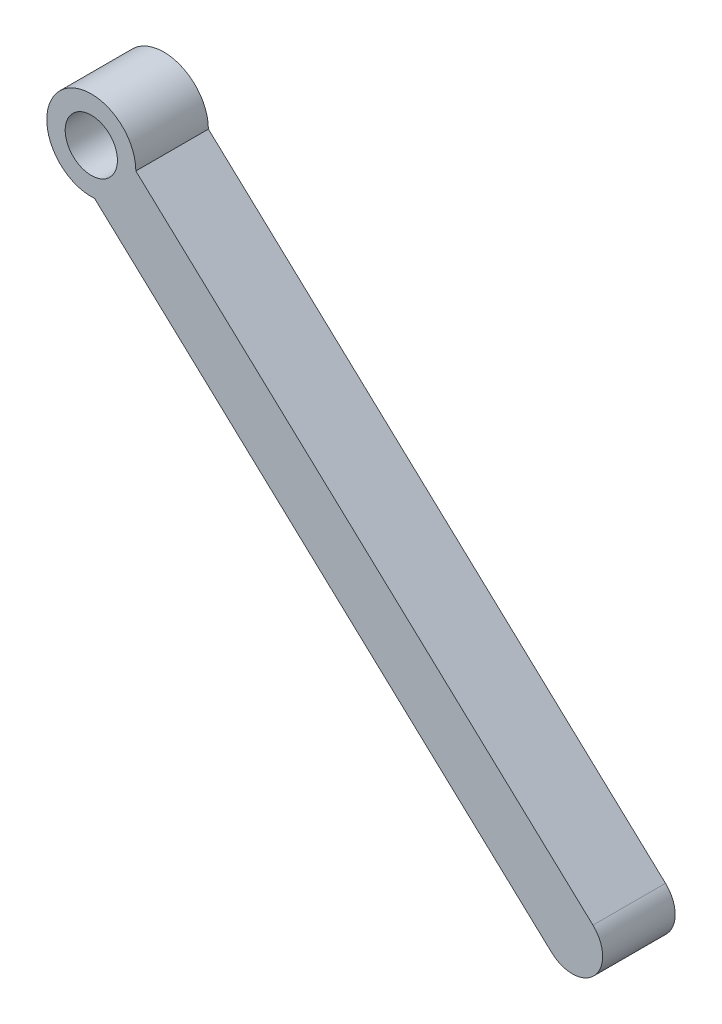
ISO-10303-21;
HEADER;
FILE_DESCRIPTION(('STEP AP214'),'2;1');
FILE_NAME('part.step','',(''),(''),'','','');
FILE_SCHEMA(('AUTOMOTIVE_DESIGN { 1 0 10303 214 1 1 1 1 }'));
ENDSEC;
DATA;
#1=APPLICATION_CONTEXT('core data for automotive mechanical design processes');
#2=APPLICATION_PROTOCOL_DEFINITION('international standard','automotive_design',2000,#1);
#3=PRODUCT_CONTEXT('',#1,'mechanical');
#4=PRODUCT('Part','Part','',(#3));
#5=PRODUCT_RELATED_PRODUCT_CATEGORY('part','',(#4));
#6=PRODUCT_DEFINITION_FORMATION('','',#4);
#7=PRODUCT_DEFINITION_CONTEXT('part definition',#1,'design');
#8=PRODUCT_DEFINITION('design','',#6,#7);
#9=PRODUCT_DEFINITION_SHAPE('','',#8);
#10=(LENGTH_UNIT() NAMED_UNIT(*) SI_UNIT(.MILLI.,.METRE.));
#11=(NAMED_UNIT(*) PLANE_ANGLE_UNIT() SI_UNIT($,.RADIAN.));
#12=(NAMED_UNIT(*) SI_UNIT($,.STERADIAN.) SOLID_ANGLE_UNIT());
#13=UNCERTAINTY_MEASURE_WITH_UNIT(LENGTH_MEASURE(1.E-05),#10,'distance_accuracy_value','');
#14=(GEOMETRIC_REPRESENTATION_CONTEXT(3) GLOBAL_UNCERTAINTY_ASSIGNED_CONTEXT((#13)) GLOBAL_UNIT_ASSIGNED_CONTEXT((#10,
#11,#12)) REPRESENTATION_CONTEXT('',''));
#15=CARTESIAN_POINT('',(0.,0.,0.));
#16=DIRECTION('',(0.,0.,1.));
#17=DIRECTION('',(1.,0.,0.));
#18=AXIS2_PLACEMENT_3D('',#15,#16,#17);
#19=CARTESIAN_POINT('',(16.1695571372173,-15.1218096755337,5.));
#20=DIRECTION('',(0.,0.,-1.));
#21=DIRECTION('',(-1.,0.,0.));
#22=AXIS2_PLACEMENT_3D('',#19,#20,#21);
#23=CYLINDRICAL_SURFACE('',#22,2.08872316152534);
#24=CARTESIAN_POINT('',(16.1695571372173,-15.1218096755337,0.));
#25=DIRECTION('',(0.,0.,1.));
#26=DIRECTION('',(1.,0.,0.));
#27=AXIS2_PLACEMENT_3D('',#24,#25,#26);
#28=CIRCLE('',#27,2.08872316152534);
#29=CARTESIAN_POINT('',(17.5910072480436,-13.5913705137489,0.));
#30=VERTEX_POINT('',#29);
#31=CARTESIAN_POINT('',(14.7481070263911,-16.6522488373184,0.));
#32=VERTEX_POINT('',#31);
#33=EDGE_CURVE('E102',#30,#32,#28,.F.);
#34=ORIENTED_EDGE('',*,*,#33,.F.);
#35=DIRECTION('',(0.,0.,-1.));
#36=VECTOR('',#35,1.);
#37=CARTESIAN_POINT('',(17.5910072480436,-13.5913705137489,5.));
#38=LINE('',#37,#36);
#39=CARTESIAN_POINT('',(17.5910072480436,-13.5913705137489,5.));
#40=VERTEX_POINT('',#39);
#41=EDGE_CURVE('E11',#40,#30,#38,.T.);
#42=ORIENTED_EDGE('',*,*,#41,.F.);
#43=CARTESIAN_POINT('',(16.1695571372173,-15.1218096755337,5.));
#44=DIRECTION('',(0.,0.,1.));
#45=DIRECTION('',(1.,0.,0.));
#46=AXIS2_PLACEMENT_3D('',#43,#44,#45);
#47=CIRCLE('',#46,2.08872316152534);
#48=CARTESIAN_POINT('',(14.7481070263911,-16.6522488373184,5.));
#49=VERTEX_POINT('',#48);
#50=EDGE_CURVE('E93',#40,#49,#47,.F.);
#51=ORIENTED_EDGE('',*,*,#50,.T.);
#52=DIRECTION('',(0.,0.,-1.));
#53=VECTOR('',#52,1.);
#54=CARTESIAN_POINT('',(14.7481070263911,-16.6522488373184,5.));
#55=LINE('',#54,#53);
#56=EDGE_CURVE('E73',#49,#32,#55,.T.);
#57=ORIENTED_EDGE('',*,*,#56,.T.);
#58=EDGE_LOOP('',(#34,#42,#51,#57));
#59=FACE_BOUND('',#58,.T.);
#60=ADVANCED_FACE('F35',(#59),#23,.T.);
#61=CARTESIAN_POINT('',(1.36971378589427,1.47473597729756,5.));
#62=DIRECTION('',(0.680535428059408,0.732715177375219,0.));
#63=DIRECTION('',(-0.732715177375219,0.680535428059408,0.));
#64=AXIS2_PLACEMENT_3D('',#61,#62,#63);
#65=PLANE('',#64);
#66=DIRECTION('',(0.732715177375219,-0.680535428059408,0.));
#67=VECTOR('',#66,1.);
#68=CARTESIAN_POINT('',(1.36971378589427,1.47473597729756,0.));
#69=LINE('',#68,#67);
#70=CARTESIAN_POINT('',(-13.9157453790909,15.6716528928056,0.));
#71=VERTEX_POINT('',#70);
#72=EDGE_CURVE('E86',#71,#30,#69,.T.);
#73=ORIENTED_EDGE('',*,*,#72,.F.);
#74=DIRECTION('',(0.,0.,-1.));
#75=VECTOR('',#74,1.);
#76=CARTESIAN_POINT('',(-13.9157453790909,15.6716528928056,5.));
#77=LINE('',#76,#75);
#78=CARTESIAN_POINT('',(-13.9157453790909,15.6716528928056,5.));
#79=VERTEX_POINT('',#78);
#80=EDGE_CURVE('E43',#79,#71,#77,.T.);
#81=ORIENTED_EDGE('',*,*,#80,.F.);
#82=DIRECTION('',(0.732715177375219,-0.680535428059408,0.));
#83=VECTOR('',#82,1.);
#84=CARTESIAN_POINT('',(1.36971378589427,1.47473597729756,5.));
#85=LINE('',#84,#83);
#86=EDGE_CURVE('E84',#79,#40,#85,.T.);
#87=ORIENTED_EDGE('',*,*,#86,.T.);
#88=ORIENTED_EDGE('',*,*,#41,.T.);
#89=EDGE_LOOP('',(#73,#81,#87,#88));
#90=FACE_BOUND('',#89,.T.);
#91=ADVANCED_FACE('F82',(#90),#65,.T.);
#92=CARTESIAN_POINT('',(-16.9849803893554,15.6716528928056,5.));
#93=DIRECTION('',(0.,0.,-1.));
#94=DIRECTION('',(-1.,0.,0.));
#95=AXIS2_PLACEMENT_3D('',#92,#93,#94);
#96=CYLINDRICAL_SURFACE('',#95,3.06923501026457);
#97=CARTESIAN_POINT('',(-16.9849803893554,15.6716528928056,0.));
#98=DIRECTION('',(0.,0.,1.));
#99=DIRECTION('',(1.,0.,0.));
#100=AXIS2_PLACEMENT_3D('',#97,#98,#99);
#101=CIRCLE('',#100,3.06923501026457);
#102=CARTESIAN_POINT('',(-16.7586456007434,12.6107745692361,0.));
#103=VERTEX_POINT('',#102);
#104=EDGE_CURVE('E66',#71,#103,#101,.T.);
#105=ORIENTED_EDGE('',*,*,#104,.T.);
#106=DIRECTION('',(0.,0.,-1.));
#107=VECTOR('',#106,1.);
#108=CARTESIAN_POINT('',(-16.7586456007434,12.6107745692361,5.));
#109=LINE('',#108,#107);
#110=CARTESIAN_POINT('',(-16.7586456007434,12.6107745692361,5.));
#111=VERTEX_POINT('',#110);
#112=EDGE_CURVE('E87',#111,#103,#109,.T.);
#113=ORIENTED_EDGE('',*,*,#112,.F.);
#114=CARTESIAN_POINT('',(-16.9849803893554,15.6716528928056,5.));
#115=DIRECTION('',(0.,0.,1.));
#116=DIRECTION('',(1.,0.,0.));
#117=AXIS2_PLACEMENT_3D('',#114,#115,#116);
#118=CIRCLE('',#117,3.06923501026457);
#119=EDGE_CURVE('E88',#79,#111,#118,.T.);
#120=ORIENTED_EDGE('',*,*,#119,.F.);
#121=ORIENTED_EDGE('',*,*,#80,.T.);
#122=EDGE_LOOP('',(#105,#113,#120,#121));
#123=FACE_BOUND('',#122,.T.);
#124=ADVANCED_FACE('F89',(#123),#96,.T.);
#125=CARTESIAN_POINT('',(-1.47318643575822,-1.58614234627197,5.));
#126=DIRECTION('',(0.680535428059408,0.732715177375219,0.));
#127=DIRECTION('',(-0.732715177375219,0.680535428059408,0.));
#128=AXIS2_PLACEMENT_3D('',#125,#126,#127);
#129=PLANE('',#128);
#130=DIRECTION('',(0.732715177375219,-0.680535428059408,0.));
#131=VECTOR('',#130,1.);
#132=CARTESIAN_POINT('',(-1.47318643575822,-1.58614234627197,0.));
#133=LINE('',#132,#131);
#134=EDGE_CURVE('E107',#103,#32,#133,.T.);
#135=ORIENTED_EDGE('',*,*,#134,.T.);
#136=ORIENTED_EDGE('',*,*,#56,.F.);
#137=DIRECTION('',(0.732715177375219,-0.680535428059408,0.));
#138=VECTOR('',#137,1.);
#139=CARTESIAN_POINT('',(-1.47318643575822,-1.58614234627197,5.));
#140=LINE('',#139,#138);
#141=EDGE_CURVE('E51',#111,#49,#140,.T.);
#142=ORIENTED_EDGE('',*,*,#141,.F.);
#143=ORIENTED_EDGE('',*,*,#112,.T.);
#144=EDGE_LOOP('',(#135,#136,#142,#143));
#145=FACE_BOUND('',#144,.T.);
#146=ADVANCED_FACE('F114',(#145),#129,.F.);
#147=CARTESIAN_POINT('',(-16.9849803893554,15.6716528928056,5.));
#148=DIRECTION('',(0.,0.,-1.));
#149=DIRECTION('',(-1.,0.,0.));
#150=AXIS2_PLACEMENT_3D('',#147,#148,#149);
#151=CYLINDRICAL_SURFACE('',#150,1.8);
#152=CARTESIAN_POINT('',(-16.9849803893554,15.6716528928056,5.));
#153=DIRECTION('',(0.,0.,1.));
#154=DIRECTION('',(1.,0.,0.));
#155=AXIS2_PLACEMENT_3D('',#152,#153,#154);
#156=CIRCLE('',#155,1.8);
#157=CARTESIAN_POINT('',(-15.1849803893554,15.6716528928056,5.));
#158=VERTEX_POINT('',#157);
#159=EDGE_CURVE('E99',#158,#158,#156,.T.);
#160=ORIENTED_EDGE('',*,*,#159,.T.);
#161=EDGE_LOOP('',(#160));
#162=FACE_BOUND('',#161,.T.);
#163=CARTESIAN_POINT('',(-16.9849803893554,15.6716528928056,0.));
#164=DIRECTION('',(0.,0.,1.));
#165=DIRECTION('',(1.,0.,0.));
#166=AXIS2_PLACEMENT_3D('',#163,#164,#165);
#167=CIRCLE('',#166,1.8);
#168=CARTESIAN_POINT('',(-15.1849803893554,15.6716528928056,0.));
#169=VERTEX_POINT('',#168);
#170=EDGE_CURVE('E95',#169,#169,#167,.T.);
#171=ORIENTED_EDGE('',*,*,#170,.F.);
#172=EDGE_LOOP('',(#171));
#173=FACE_BOUND('',#172,.T.);
#174=ADVANCED_FACE('F129',(#162,#173),#151,.F.);
#175=CARTESIAN_POINT('',(0.,0.,5.));
#176=DIRECTION('',(0.,0.,1.));
#177=DIRECTION('',(1.,0.,0.));
#178=AXIS2_PLACEMENT_3D('',#175,#176,#177);
#179=PLANE('',#178);
#180=ORIENTED_EDGE('',*,*,#50,.F.);
#181=ORIENTED_EDGE('',*,*,#86,.F.);
#182=ORIENTED_EDGE('',*,*,#119,.T.);
#183=ORIENTED_EDGE('',*,*,#141,.T.);
#184=EDGE_LOOP('',(#180,#181,#182,#183));
#185=FACE_BOUND('',#184,.T.);
#186=ORIENTED_EDGE('',*,*,#159,.F.);
#187=EDGE_LOOP('',(#186));
#188=FACE_BOUND('',#187,.T.);
#189=ADVANCED_FACE('F91',(#185,#188),#179,.T.);
#190=CARTESIAN_POINT('',(0.,0.,0.));
#191=DIRECTION('',(0.,0.,1.));
#192=DIRECTION('',(1.,0.,0.));
#193=AXIS2_PLACEMENT_3D('',#190,#191,#192);
#194=PLANE('',#193);
#195=ORIENTED_EDGE('',*,*,#33,.T.);
#196=ORIENTED_EDGE('',*,*,#134,.F.);
#197=ORIENTED_EDGE('',*,*,#104,.F.);
#198=ORIENTED_EDGE('',*,*,#72,.T.);
#199=EDGE_LOOP('',(#195,#196,#197,#198));
#200=FACE_BOUND('',#199,.T.);
#201=ORIENTED_EDGE('',*,*,#170,.T.);
#202=EDGE_LOOP('',(#201));
#203=FACE_BOUND('',#202,.T.);
#204=ADVANCED_FACE('F116',(#200,#203),#194,.F.);
#205=CLOSED_SHELL('',(#60,#91,#124,#146,#174,#189,#204));
#206=MANIFOLD_SOLID_BREP('B2',#205);
#207=ADVANCED_BREP_SHAPE_REPRESENTATION('',(#18,#206),#14);
#208=SHAPE_DEFINITION_REPRESENTATION(#9,#207);
ENDSEC;
END-ISO-10303-21;
